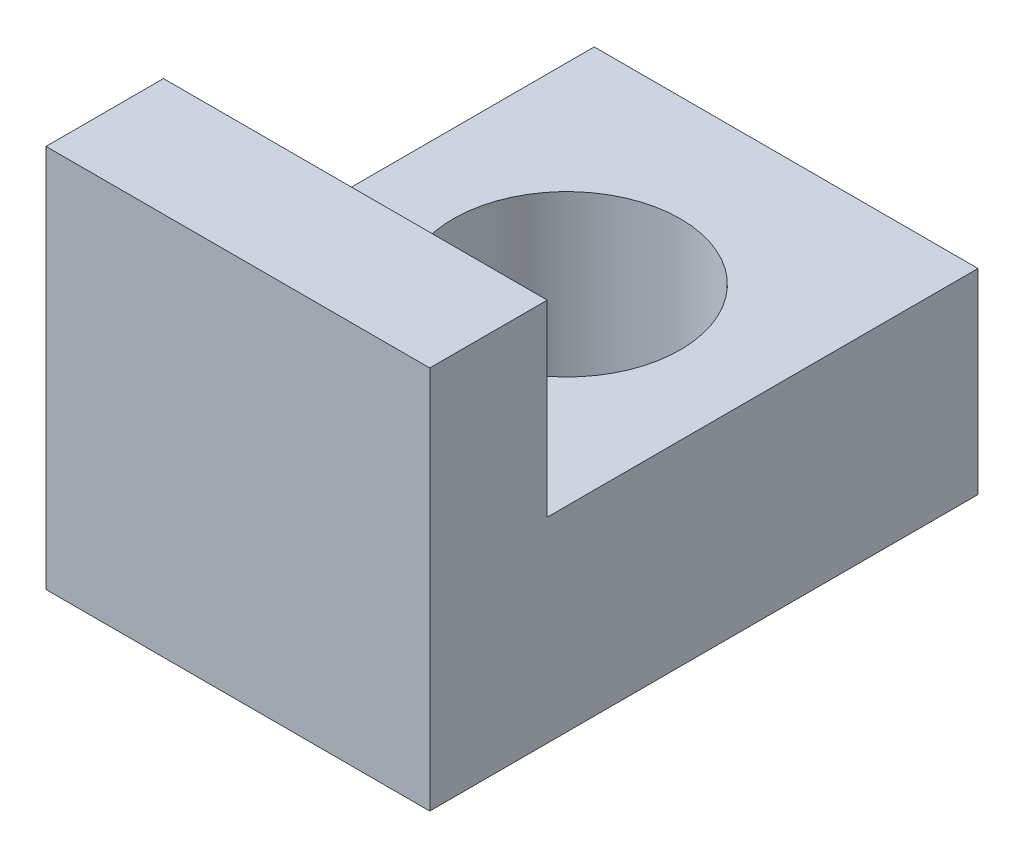
ISO-10303-21;
HEADER;
FILE_DESCRIPTION(('STEP AP214'),'2;1');
FILE_NAME('part.step','',(''),(''),'','','');
FILE_SCHEMA(('AUTOMOTIVE_DESIGN { 1 0 10303 214 1 1 1 1 }'));
ENDSEC;
DATA;
#1=APPLICATION_CONTEXT('core data for automotive mechanical design processes');
#2=APPLICATION_PROTOCOL_DEFINITION('international standard','automotive_design',2000,#1);
#3=PRODUCT_CONTEXT('',#1,'mechanical');
#4=PRODUCT('Part','Part','',(#3));
#5=PRODUCT_RELATED_PRODUCT_CATEGORY('part','',(#4));
#6=PRODUCT_DEFINITION_FORMATION('','',#4);
#7=PRODUCT_DEFINITION_CONTEXT('part definition',#1,'design');
#8=PRODUCT_DEFINITION('design','',#6,#7);
#9=PRODUCT_DEFINITION_SHAPE('','',#8);
#10=(LENGTH_UNIT() NAMED_UNIT(*) SI_UNIT(.MILLI.,.METRE.));
#11=(NAMED_UNIT(*) PLANE_ANGLE_UNIT() SI_UNIT($,.RADIAN.));
#12=(NAMED_UNIT(*) SI_UNIT($,.STERADIAN.) SOLID_ANGLE_UNIT());
#13=UNCERTAINTY_MEASURE_WITH_UNIT(LENGTH_MEASURE(1.E-05),#10,'distance_accuracy_value','');
#14=(GEOMETRIC_REPRESENTATION_CONTEXT(3) GLOBAL_UNCERTAINTY_ASSIGNED_CONTEXT((#13)) GLOBAL_UNIT_ASSIGNED_CONTEXT((#10,
#11,#12)) REPRESENTATION_CONTEXT('',''));
#15=CARTESIAN_POINT('',(0.,0.,0.));
#16=DIRECTION('',(0.,0.,1.));
#17=DIRECTION('',(1.,0.,0.));
#18=AXIS2_PLACEMENT_3D('',#15,#16,#17);
#19=CARTESIAN_POINT('',(4.9,0.,-7.));
#20=DIRECTION('',(0.,1.,0.));
#21=DIRECTION('',(0.,0.,1.));
#22=AXIS2_PLACEMENT_3D('',#19,#20,#21);
#23=PLANE('',#22);
#24=CARTESIAN_POINT('',(2.45,0.,-4.2));
#25=DIRECTION('',(0.,-1.,0.));
#26=DIRECTION('',(0.,0.,-1.));
#27=AXIS2_PLACEMENT_3D('',#24,#25,#26);
#28=CIRCLE('',#27,1.45);
#29=CARTESIAN_POINT('',(2.45,0.,-5.65));
#30=VERTEX_POINT('',#29);
#31=EDGE_CURVE('E162',#30,#30,#28,.T.);
#32=ORIENTED_EDGE('',*,*,#31,.F.);
#33=EDGE_LOOP('',(#32));
#34=FACE_BOUND('',#33,.T.);
#35=DIRECTION('',(0.,0.,-1.));
#36=VECTOR('',#35,1.);
#37=CARTESIAN_POINT('',(0.,0.,-7.));
#38=LINE('',#37,#36);
#39=CARTESIAN_POINT('',(0.,0.,0.));
#40=VERTEX_POINT('',#39);
#41=CARTESIAN_POINT('',(0.,0.,-7.));
#42=VERTEX_POINT('',#41);
#43=EDGE_CURVE('E120',#40,#42,#38,.T.);
#44=ORIENTED_EDGE('',*,*,#43,.T.);
#45=DIRECTION('',(-1.,0.,0.));
#46=VECTOR('',#45,1.);
#47=CARTESIAN_POINT('',(4.9,0.,-7.));
#48=LINE('',#47,#46);
#49=CARTESIAN_POINT('',(4.9,0.,-7.));
#50=VERTEX_POINT('',#49);
#51=EDGE_CURVE('E11',#50,#42,#48,.T.);
#52=ORIENTED_EDGE('',*,*,#51,.F.);
#53=DIRECTION('',(0.,0.,-1.));
#54=VECTOR('',#53,1.);
#55=CARTESIAN_POINT('',(4.9,0.,-7.));
#56=LINE('',#55,#54);
#57=CARTESIAN_POINT('',(4.9,0.,0.));
#58=VERTEX_POINT('',#57);
#59=EDGE_CURVE('E130',#58,#50,#56,.T.);
#60=ORIENTED_EDGE('',*,*,#59,.F.);
#61=DIRECTION('',(-1.,0.,0.));
#62=VECTOR('',#61,1.);
#63=CARTESIAN_POINT('',(4.9,0.,0.));
#64=LINE('',#63,#62);
#65=EDGE_CURVE('E116',#58,#40,#64,.T.);
#66=ORIENTED_EDGE('',*,*,#65,.T.);
#67=EDGE_LOOP('',(#44,#52,#60,#66));
#68=FACE_BOUND('',#67,.T.);
#69=ADVANCED_FACE('F35',(#34,#68),#23,.F.);
#70=CARTESIAN_POINT('',(4.9,2.5,-7.));
#71=DIRECTION('',(0.,0.,1.));
#72=DIRECTION('',(1.,0.,0.));
#73=AXIS2_PLACEMENT_3D('',#70,#71,#72);
#74=PLANE('',#73);
#75=DIRECTION('',(0.,1.,0.));
#76=VECTOR('',#75,1.);
#77=CARTESIAN_POINT('',(0.,2.5,-7.));
#78=LINE('',#77,#76);
#79=CARTESIAN_POINT('',(0.,2.5,-7.));
#80=VERTEX_POINT('',#79);
#81=EDGE_CURVE('E123',#42,#80,#78,.T.);
#82=ORIENTED_EDGE('',*,*,#81,.T.);
#83=DIRECTION('',(-1.,0.,0.));
#84=VECTOR('',#83,1.);
#85=CARTESIAN_POINT('',(4.9,2.5,-7.));
#86=LINE('',#85,#84);
#87=CARTESIAN_POINT('',(4.9,2.5,-7.));
#88=VERTEX_POINT('',#87);
#89=EDGE_CURVE('E44',#88,#80,#86,.T.);
#90=ORIENTED_EDGE('',*,*,#89,.F.);
#91=DIRECTION('',(0.,1.,0.));
#92=VECTOR('',#91,1.);
#93=CARTESIAN_POINT('',(4.9,2.5,-7.));
#94=LINE('',#93,#92);
#95=EDGE_CURVE('E89',#50,#88,#94,.T.);
#96=ORIENTED_EDGE('',*,*,#95,.F.);
#97=ORIENTED_EDGE('',*,*,#51,.T.);
#98=EDGE_LOOP('',(#82,#90,#96,#97));
#99=FACE_BOUND('',#98,.T.);
#100=ADVANCED_FACE('F155',(#99),#74,.F.);
#101=CARTESIAN_POINT('',(4.9,2.5,-1.5));
#102=DIRECTION('',(0.,-1.,0.));
#103=DIRECTION('',(0.,0.,-1.));
#104=AXIS2_PLACEMENT_3D('',#101,#102,#103);
#105=PLANE('',#104);
#106=CARTESIAN_POINT('',(2.45,2.5,-4.2));
#107=DIRECTION('',(0.,-1.,0.));
#108=DIRECTION('',(0.,0.,-1.));
#109=AXIS2_PLACEMENT_3D('',#106,#107,#108);
#110=CIRCLE('',#109,1.45);
#111=CARTESIAN_POINT('',(2.45,2.5,-5.65));
#112=VERTEX_POINT('',#111);
#113=EDGE_CURVE('E38',#112,#112,#110,.T.);
#114=ORIENTED_EDGE('',*,*,#113,.T.);
#115=EDGE_LOOP('',(#114));
#116=FACE_BOUND('',#115,.T.);
#117=DIRECTION('',(0.,0.,1.));
#118=VECTOR('',#117,1.);
#119=CARTESIAN_POINT('',(0.,2.5,-1.5));
#120=LINE('',#119,#118);
#121=CARTESIAN_POINT('',(0.,2.5,-1.5));
#122=VERTEX_POINT('',#121);
#123=EDGE_CURVE('E125',#80,#122,#120,.T.);
#124=ORIENTED_EDGE('',*,*,#123,.T.);
#125=DIRECTION('',(-1.,0.,0.));
#126=VECTOR('',#125,1.);
#127=CARTESIAN_POINT('',(4.9,2.5,-1.5));
#128=LINE('',#127,#126);
#129=CARTESIAN_POINT('',(4.9,2.5,-1.5));
#130=VERTEX_POINT('',#129);
#131=EDGE_CURVE('E111',#130,#122,#128,.T.);
#132=ORIENTED_EDGE('',*,*,#131,.F.);
#133=DIRECTION('',(0.,0.,1.));
#134=VECTOR('',#133,1.);
#135=CARTESIAN_POINT('',(4.9,2.5,-1.5));
#136=LINE('',#135,#134);
#137=EDGE_CURVE('E102',#88,#130,#136,.T.);
#138=ORIENTED_EDGE('',*,*,#137,.F.);
#139=ORIENTED_EDGE('',*,*,#89,.T.);
#140=EDGE_LOOP('',(#124,#132,#138,#139));
#141=FACE_BOUND('',#140,.T.);
#142=ADVANCED_FACE('F137',(#116,#141),#105,.F.);
#143=CARTESIAN_POINT('',(4.9,4.9,-1.5));
#144=DIRECTION('',(0.,0.,1.));
#145=DIRECTION('',(0.,-1.,0.));
#146=AXIS2_PLACEMENT_3D('',#143,#144,#145);
#147=PLANE('',#146);
#148=DIRECTION('',(0.,1.,0.));
#149=VECTOR('',#148,1.);
#150=CARTESIAN_POINT('',(0.,4.9,-1.5));
#151=LINE('',#150,#149);
#152=CARTESIAN_POINT('',(0.,4.9,-1.5));
#153=VERTEX_POINT('',#152);
#154=EDGE_CURVE('E110',#122,#153,#151,.T.);
#155=ORIENTED_EDGE('',*,*,#154,.T.);
#156=DIRECTION('',(-1.,0.,0.));
#157=VECTOR('',#156,1.);
#158=CARTESIAN_POINT('',(4.9,4.9,-1.5));
#159=LINE('',#158,#157);
#160=CARTESIAN_POINT('',(4.9,4.9,-1.5));
#161=VERTEX_POINT('',#160);
#162=EDGE_CURVE('E107',#161,#153,#159,.T.);
#163=ORIENTED_EDGE('',*,*,#162,.F.);
#164=DIRECTION('',(0.,1.,0.));
#165=VECTOR('',#164,1.);
#166=CARTESIAN_POINT('',(4.9,4.9,-1.5));
#167=LINE('',#166,#165);
#168=EDGE_CURVE('E96',#130,#161,#167,.T.);
#169=ORIENTED_EDGE('',*,*,#168,.F.);
#170=ORIENTED_EDGE('',*,*,#131,.T.);
#171=EDGE_LOOP('',(#155,#163,#169,#170));
#172=FACE_BOUND('',#171,.T.);
#173=ADVANCED_FACE('F108',(#172),#147,.F.);
#174=CARTESIAN_POINT('',(4.9,4.9,0.));
#175=DIRECTION('',(0.,-1.,0.));
#176=DIRECTION('',(0.,0.,-1.));
#177=AXIS2_PLACEMENT_3D('',#174,#175,#176);
#178=PLANE('',#177);
#179=DIRECTION('',(0.,0.,1.));
#180=VECTOR('',#179,1.);
#181=CARTESIAN_POINT('',(0.,4.9,0.));
#182=LINE('',#181,#180);
#183=CARTESIAN_POINT('',(0.,4.9,0.));
#184=VERTEX_POINT('',#183);
#185=EDGE_CURVE('E75',#153,#184,#182,.T.);
#186=ORIENTED_EDGE('',*,*,#185,.T.);
#187=DIRECTION('',(-1.,0.,0.));
#188=VECTOR('',#187,1.);
#189=CARTESIAN_POINT('',(4.9,4.9,0.));
#190=LINE('',#189,#188);
#191=CARTESIAN_POINT('',(4.9,4.9,0.));
#192=VERTEX_POINT('',#191);
#193=EDGE_CURVE('E112',#192,#184,#190,.T.);
#194=ORIENTED_EDGE('',*,*,#193,.F.);
#195=DIRECTION('',(0.,0.,1.));
#196=VECTOR('',#195,1.);
#197=CARTESIAN_POINT('',(4.9,4.9,0.));
#198=LINE('',#197,#196);
#199=EDGE_CURVE('E100',#161,#192,#198,.T.);
#200=ORIENTED_EDGE('',*,*,#199,.F.);
#201=ORIENTED_EDGE('',*,*,#162,.T.);
#202=EDGE_LOOP('',(#186,#194,#200,#201));
#203=FACE_BOUND('',#202,.T.);
#204=ADVANCED_FACE('F114',(#203),#178,.F.);
#205=CARTESIAN_POINT('',(4.9,0.,0.));
#206=DIRECTION('',(0.,0.,-1.));
#207=DIRECTION('',(-1.,0.,0.));
#208=AXIS2_PLACEMENT_3D('',#205,#206,#207);
#209=PLANE('',#208);
#210=DIRECTION('',(0.,-1.,0.));
#211=VECTOR('',#210,1.);
#212=CARTESIAN_POINT('',(0.,0.,0.));
#213=LINE('',#212,#211);
#214=EDGE_CURVE('E81',#184,#40,#213,.T.);
#215=ORIENTED_EDGE('',*,*,#214,.T.);
#216=ORIENTED_EDGE('',*,*,#65,.F.);
#217=DIRECTION('',(0.,-1.,0.));
#218=VECTOR('',#217,1.);
#219=CARTESIAN_POINT('',(4.9,0.,0.));
#220=LINE('',#219,#218);
#221=EDGE_CURVE('E52',#192,#58,#220,.T.);
#222=ORIENTED_EDGE('',*,*,#221,.F.);
#223=ORIENTED_EDGE('',*,*,#193,.T.);
#224=EDGE_LOOP('',(#215,#216,#222,#223));
#225=FACE_BOUND('',#224,.T.);
#226=ADVANCED_FACE('F144',(#225),#209,.F.);
#227=CARTESIAN_POINT('',(4.9,0.,0.));
#228=DIRECTION('',(-1.,0.,0.));
#229=DIRECTION('',(0.,0.,1.));
#230=AXIS2_PLACEMENT_3D('',#227,#228,#229);
#231=PLANE('',#230);
#232=ORIENTED_EDGE('',*,*,#59,.T.);
#233=ORIENTED_EDGE('',*,*,#95,.T.);
#234=ORIENTED_EDGE('',*,*,#137,.T.);
#235=ORIENTED_EDGE('',*,*,#168,.T.);
#236=ORIENTED_EDGE('',*,*,#199,.T.);
#237=ORIENTED_EDGE('',*,*,#221,.T.);
#238=EDGE_LOOP('',(#232,#233,#234,#235,#236,#237));
#239=FACE_BOUND('',#238,.T.);
#240=ADVANCED_FACE('F98',(#239),#231,.F.);
#241=CARTESIAN_POINT('',(0.,0.,0.));
#242=DIRECTION('',(-1.,0.,0.));
#243=DIRECTION('',(0.,0.,1.));
#244=AXIS2_PLACEMENT_3D('',#241,#242,#243);
#245=PLANE('',#244);
#246=ORIENTED_EDGE('',*,*,#43,.F.);
#247=ORIENTED_EDGE('',*,*,#214,.F.);
#248=ORIENTED_EDGE('',*,*,#185,.F.);
#249=ORIENTED_EDGE('',*,*,#154,.F.);
#250=ORIENTED_EDGE('',*,*,#123,.F.);
#251=ORIENTED_EDGE('',*,*,#81,.F.);
#252=EDGE_LOOP('',(#246,#247,#248,#249,#250,#251));
#253=FACE_BOUND('',#252,.T.);
#254=ADVANCED_FACE('F140',(#253),#245,.T.);
#255=CARTESIAN_POINT('',(2.45,4.9,-4.2));
#256=DIRECTION('',(0.,-1.,0.));
#257=DIRECTION('',(0.,0.,-1.));
#258=AXIS2_PLACEMENT_3D('',#255,#256,#257);
#259=CYLINDRICAL_SURFACE('',#258,1.45);
#260=ORIENTED_EDGE('',*,*,#31,.T.);
#261=EDGE_LOOP('',(#260));
#262=FACE_BOUND('',#261,.T.);
#263=ORIENTED_EDGE('',*,*,#113,.F.);
#264=EDGE_LOOP('',(#263));
#265=FACE_BOUND('',#264,.T.);
#266=ADVANCED_FACE('F171',(#262,#265),#259,.F.);
#267=CLOSED_SHELL('',(#69,#100,#142,#173,#204,#226,#240,#254,#266));
#268=MANIFOLD_SOLID_BREP('B2',#267);
#269=ADVANCED_BREP_SHAPE_REPRESENTATION('',(#18,#268),#14);
#270=SHAPE_DEFINITION_REPRESENTATION(#9,#269);
ENDSEC;
END-ISO-10303-21;
